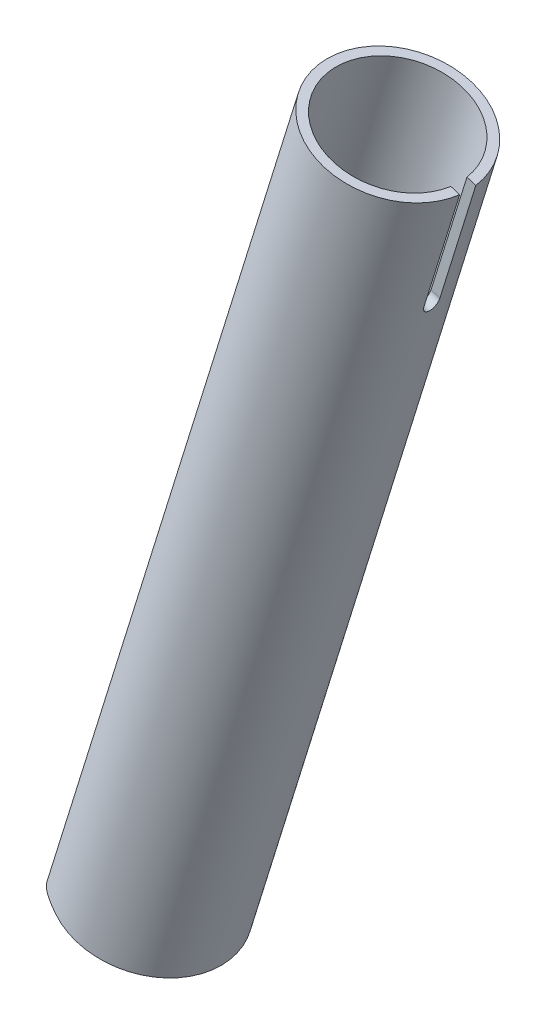
ISO-10303-21;
HEADER;
FILE_DESCRIPTION(('STEP AP214'),'2;1');
FILE_NAME('part.step','',(''),(''),'','','');
FILE_SCHEMA(('AUTOMOTIVE_DESIGN { 1 0 10303 214 1 1 1 1 }'));
ENDSEC;
DATA;
#1=APPLICATION_CONTEXT('core data for automotive mechanical design processes');
#2=APPLICATION_PROTOCOL_DEFINITION('international standard','automotive_design',2000,#1);
#3=PRODUCT_CONTEXT('',#1,'mechanical');
#4=PRODUCT('Part','Part','',(#3));
#5=PRODUCT_RELATED_PRODUCT_CATEGORY('part','',(#4));
#6=PRODUCT_DEFINITION_FORMATION('','',#4);
#7=PRODUCT_DEFINITION_CONTEXT('part definition',#1,'design');
#8=PRODUCT_DEFINITION('design','',#6,#7);
#9=PRODUCT_DEFINITION_SHAPE('','',#8);
#10=(LENGTH_UNIT() NAMED_UNIT(*) SI_UNIT(.MILLI.,.METRE.));
#11=(NAMED_UNIT(*) PLANE_ANGLE_UNIT() SI_UNIT($,.RADIAN.));
#12=(NAMED_UNIT(*) SI_UNIT($,.STERADIAN.) SOLID_ANGLE_UNIT());
#13=UNCERTAINTY_MEASURE_WITH_UNIT(LENGTH_MEASURE(1.E-05),#10,'distance_accuracy_value','');
#14=(GEOMETRIC_REPRESENTATION_CONTEXT(3) GLOBAL_UNCERTAINTY_ASSIGNED_CONTEXT((#13)) GLOBAL_UNIT_ASSIGNED_CONTEXT((#10,
#11,#12)) REPRESENTATION_CONTEXT('',''));
#15=CARTESIAN_POINT('',(0.,0.,0.));
#16=DIRECTION('',(0.,0.,1.));
#17=DIRECTION('',(1.,0.,0.));
#18=AXIS2_PLACEMENT_3D('',#15,#16,#17);
#19=CARTESIAN_POINT('',(71.753350031558,230.850995331577,0.));
#20=DIRECTION('',(0.296814001361883,0.9549353112099,0.));
#21=DIRECTION('',(-0.9549353112099,0.296814001361883,0.));
#22=AXIS2_PLACEMENT_3D('',#19,#20,#21);
#23=CYLINDRICAL_SURFACE('',#22,16.);
#24=CARTESIAN_POINT('',(89.1024615678621,306.882715939735,-14.8323969741913));
#25=CARTESIAN_POINT('',(88.9636789143046,306.925853625691,-14.7736102770657));
#26=CARTESIAN_POINT('',(88.8248106555613,306.965697551553,-14.7126935656479));
#27=CARTESIAN_POINT('',(88.5472654781601,307.038943486681,-14.586759021269));
#28=CARTESIAN_POINT('',(88.4085885291525,307.0723466728,-14.5217419404138));
#29=CARTESIAN_POINT('',(87.9938110120856,307.163026168156,-14.3209864843538));
#30=CARTESIAN_POINT('',(87.7184611401856,307.210926750773,-14.1793309230726));
#31=CARTESIAN_POINT('',(87.1752732700831,307.282773014785,-13.8833327226576));
#32=CARTESIAN_POINT('',(86.9073873822273,307.306957039612,-13.729133543188));
#33=CARTESIAN_POINT('',(86.3779800650861,307.333908688674,-13.4082293127839));
#34=CARTESIAN_POINT('',(86.116461880451,307.336665613374,-13.2415180559385));
#35=CARTESIAN_POINT('',(85.5373138379756,307.320708899526,-12.8542772904973));
#36=CARTESIAN_POINT('',(85.2218916095013,307.296488947746,-12.6306695450833));
#37=CARTESIAN_POINT('',(84.6053720536828,307.220669106254,-12.1689339396761));
#38=CARTESIAN_POINT('',(84.3042767604437,307.169065341215,-11.9308040287452));
#39=CARTESIAN_POINT('',(83.7163306616415,307.041308758366,-11.441248800487));
#40=CARTESIAN_POINT('',(83.4295479929272,306.965049448999,-11.1897698378056));
#41=CARTESIAN_POINT('',(82.8723467146832,306.790885554024,-10.6764756791457));
#42=CARTESIAN_POINT('',(82.6019293065508,306.692979381738,-10.4146597266395));
#43=CARTESIAN_POINT('',(81.9745066955571,306.435664466389,-9.77746944986866));
#44=CARTESIAN_POINT('',(81.6253528216682,306.267220839098,-9.39798788600657));
#45=CARTESIAN_POINT('',(80.95969075539,305.898873380647,-8.62586596573185));
#46=CARTESIAN_POINT('',(80.643195249092,305.698957399693,-8.23322057373231));
#47=CARTESIAN_POINT('',(80.0425697501543,305.272274832941,-7.43754751903833));
#48=CARTESIAN_POINT('',(79.7584595370888,305.045492008597,-7.03451369380498));
#49=CARTESIAN_POINT('',(79.2225479863687,304.569101071878,-6.22072089942956));
#50=CARTESIAN_POINT('',(78.9707427369578,304.319495729327,-5.80996287251813));
#51=CARTESIAN_POINT('',(78.4840201123546,303.784099080961,-4.95617797917473));
#52=CARTESIAN_POINT('',(78.2512063358746,303.497015008781,-4.51276481761032));
#53=CARTESIAN_POINT('',(77.8214597607559,302.903862879695,-3.62118824914521));
#54=CARTESIAN_POINT('',(77.6245336983808,302.597791273177,-3.17302396711186));
#55=CARTESIAN_POINT('',(77.2669543135226,301.970170731178,-2.27465354285216));
#56=CARTESIAN_POINT('',(77.1062273571681,301.648654858773,-1.82445348104745));
#57=CARTESIAN_POINT('',(76.8208035908239,300.992107629926,-0.92274025697174));
#58=CARTESIAN_POINT('',(76.6960892877962,300.657082925796,-0.471227840196273));
#59=CARTESIAN_POINT('',(76.5880768887487,300.311489773514,-0.0132303433696181));
#60=CARTESIAN_POINT('',(76.5865207037954,300.306496904307,-0.00661515629981239));
#61=CARTESIAN_POINT('',(76.5849684421444,300.301502841254,0.));
#62=B_SPLINE_CURVE_WITH_KNOTS('',3,(#24,#25,#26,#27,#28,#29,#30,#31,#32,#33,#34,#35,#36,#37,#38,
#39,#40,#41,#42,#43,#44,#45,#46,#47,#48,#49,#50,#51,#52,#53,#54,#55,#56,#57,#58,#59,#60,#61),
.UNSPECIFIED.,.F.,.F.,(4,2,2,2,2,2,2,2,2,2,2,2,2,2,2,2,2,2,4),(0.,0.47020829482799,
0.940330591632603,1.87888043703225,2.80789844663228,3.73738032781409,4.89786417340659,
6.05851229317381,7.22424196576735,8.39005711270434,10.0150965334015,11.6407648404096,
13.2674207766438,14.8938795574271,16.624146027115,18.3547369407864,20.0817751493295,
21.8079730376149,21.8332712618901),.UNSPECIFIED.);
#63=CARTESIAN_POINT('',(76.5849684421442,300.301502841254,0.));
#64=VERTEX_POINT('',#63);
#65=CARTESIAN_POINT('',(89.1024615678621,306.882715939734,-14.8323969741913));
#66=VERTEX_POINT('',#65);
#67=EDGE_CURVE('E132',#64,#66,#62,.F.);
#68=ORIENTED_EDGE('',*,*,#67,.F.);
#69=CARTESIAN_POINT('',(89.1024615678621,306.882715939735,14.8323969741913));
#70=CARTESIAN_POINT('',(88.9636789143047,306.925853625691,14.7736102770657));
#71=CARTESIAN_POINT('',(88.8248106555614,306.965697551553,14.712693565648));
#72=CARTESIAN_POINT('',(88.5472654781602,307.038943486681,14.5867590212691));
#73=CARTESIAN_POINT('',(88.4085885291527,307.0723466728,14.5217419404139));
#74=CARTESIAN_POINT('',(87.9938110120859,307.163026168156,14.320986484354));
#75=CARTESIAN_POINT('',(87.718461140186,307.210926750773,14.1793309230728));
#76=CARTESIAN_POINT('',(87.1752732700835,307.282773014785,13.8833327226578));
#77=CARTESIAN_POINT('',(86.9073873822275,307.306957039612,13.7291335431881));
#78=CARTESIAN_POINT('',(86.3779800650862,307.333908688674,13.408229312784));
#79=CARTESIAN_POINT('',(86.1164618804511,307.336665613374,13.2415180559385));
#80=CARTESIAN_POINT('',(85.5373138379755,307.320708899526,12.8542772904973));
#81=CARTESIAN_POINT('',(85.2218916095012,307.296488947746,12.6306695450832));
#82=CARTESIAN_POINT('',(84.6053720536826,307.220669106254,12.1689339396759));
#83=CARTESIAN_POINT('',(84.3042767604434,307.169065341215,11.930804028745));
#84=CARTESIAN_POINT('',(83.7163306616413,307.041308758366,11.4412488004868));
#85=CARTESIAN_POINT('',(83.429547992927,306.965049448999,11.1897698378054));
#86=CARTESIAN_POINT('',(82.8723467146831,306.790885554024,10.6764756791456));
#87=CARTESIAN_POINT('',(82.6019293065507,306.692979381738,10.4146597266395));
#88=CARTESIAN_POINT('',(81.9745066955572,306.43566446639,9.77746944986874));
#89=CARTESIAN_POINT('',(81.6253528216684,306.267220839098,9.39798788600675));
#90=CARTESIAN_POINT('',(80.9596907553903,305.898873380648,8.62586596573219));
#91=CARTESIAN_POINT('',(80.6431952490923,305.698957399693,8.23322057373272));
#92=CARTESIAN_POINT('',(80.0425697501547,305.272274832941,7.43754751903876));
#93=CARTESIAN_POINT('',(79.758459537089,305.045492008597,7.03451369380535));
#94=CARTESIAN_POINT('',(79.2225479863688,304.569101071879,6.2207208994297));
#95=CARTESIAN_POINT('',(78.9707427369579,304.319495729327,5.80996287251808));
#96=CARTESIAN_POINT('',(78.4840201123545,303.784099080961,4.95617797917488));
#97=CARTESIAN_POINT('',(78.2512063358743,303.497015008781,4.51276481761089));
#98=CARTESIAN_POINT('',(77.8214597607561,302.903862879696,3.62118824914459));
#99=CARTESIAN_POINT('',(77.6245336983816,302.597791273179,3.17302396710965));
#100=CARTESIAN_POINT('',(77.2669543135218,301.970170731176,2.27465354285411));
#101=CARTESIAN_POINT('',(77.1062273571651,301.648654858763,1.82445348105515));
#102=CARTESIAN_POINT('',(76.8208035908268,300.992107629936,0.922740256963934));
#103=CARTESIAN_POINT('',(76.6960892878072,300.657082925831,0.471227840167233));
#104=CARTESIAN_POINT('',(76.5880768887491,300.311489773515,0.013230343368807));
#105=CARTESIAN_POINT('',(76.5865207037955,300.306496904308,0.00661515629940148));
#106=CARTESIAN_POINT('',(76.5849684421444,300.301502841254,0.));
#107=B_SPLINE_CURVE_WITH_KNOTS('',3,(#69,#70,#71,#72,#73,#74,#75,#76,#77,#78,#79,#80,#81,#82,
#83,#84,#85,#86,#87,#88,#89,#90,#91,#92,#93,#94,#95,#96,#97,#98,#99,#100,#101,#102,#103,#104,
#105,#106),.UNSPECIFIED.,.F.,.F.,(4,2,2,2,2,2,2,2,2,2,2,2,2,2,2,2,2,2,4),(0.,0.470208294827854,
0.940330591632331,1.87888043703174,2.80789844663203,3.73738032781409,4.89786417340678,
6.05851229317418,7.22424196576758,8.39005711270433,10.0150965334011,11.6407648404089,
13.2674207766435,14.893879557427,16.624146027115,18.3547369407866,20.0817751493296,
21.8079730376148,21.8332712618901),.UNSPECIFIED.);
#108=CARTESIAN_POINT('',(89.1024615678621,306.882715939734,14.8323969741913));
#109=VERTEX_POINT('',#108);
#110=EDGE_CURVE('E108',#109,#64,#107,.T.);
#111=ORIENTED_EDGE('',*,*,#110,.F.);
#112=CARTESIAN_POINT('',(94.8320734351215,305.101831931563,0.));
#113=DIRECTION('',(0.296814001361883,0.9549353112099,0.));
#114=DIRECTION('',(-0.9549353112099,0.296814001361883,0.));
#115=AXIS2_PLACEMENT_3D('',#112,#113,#114);
#116=CIRCLE('',#115,16.);
#117=EDGE_CURVE('E137',#66,#109,#116,.F.);
#118=ORIENTED_EDGE('',*,*,#117,.F.);
#119=EDGE_LOOP('',(#68,#111,#118));
#120=FACE_BOUND('',#119,.T.);
#121=CARTESIAN_POINT('',(155.80293286088,447.680071157907,-1.75000000000004));
#122=CARTESIAN_POINT('',(155.788364601699,447.633205295976,-1.74999984854716));
#123=CARTESIAN_POINT('',(155.774023061292,447.586293738003,-1.74793414953128));
#124=CARTESIAN_POINT('',(155.745871314609,447.492676076905,-1.73969438553421));
#125=CARTESIAN_POINT('',(155.732061071143,447.445969959603,-1.73352060866503));
#126=CARTESIAN_POINT('',(155.691590798359,447.306766058352,-1.70890105298895));
#127=CARTESIAN_POINT('',(155.665837052925,447.215008099155,-1.68435685468124));
#128=CARTESIAN_POINT('',(155.61732615962,447.03632763853,-1.61970881462559));
#129=CARTESIAN_POINT('',(155.594570092523,446.949406887584,-1.57959938148605));
#130=CARTESIAN_POINT('',(155.55235522321,446.782918939888,-1.4849728928261));
#131=CARTESIAN_POINT('',(155.532896072991,446.703350967429,-1.43045735947844));
#132=CARTESIAN_POINT('',(155.497345326152,446.553625831101,-1.30832184530033));
#133=CARTESIAN_POINT('',(155.481266647058,446.483505120998,-1.24065343320973));
#134=CARTESIAN_POINT('',(155.452576291235,446.355110628299,-1.09422795085695));
#135=CARTESIAN_POINT('',(155.43996514246,446.296838650101,-1.01546919477598));
#136=CARTESIAN_POINT('',(155.418121580952,446.193801874277,-0.848861111640837));
#137=CARTESIAN_POINT('',(155.408897676371,446.14907113861,-0.760989594645314));
#138=CARTESIAN_POINT('',(155.393781675449,446.074719705114,-0.578809465749656));
#139=CARTESIAN_POINT('',(155.387889283793,446.045097668031,-0.484501425232282));
#140=CARTESIAN_POINT('',(155.379372209535,446.001994281873,-0.292520945329283));
#141=CARTESIAN_POINT('',(155.376734542945,445.988448807305,-0.194863481971559));
#142=CARTESIAN_POINT('',(155.374642682994,445.97772139226,0.00138072986707152));
#143=CARTESIAN_POINT('',(155.375188469676,445.980539349201,0.0999674725184971));
#144=CARTESIAN_POINT('',(155.379463059454,446.00239967363,0.294824184361292));
#145=CARTESIAN_POINT('',(155.383178217962,446.021372491528,0.391102268601931));
#146=CARTESIAN_POINT('',(155.393828846422,446.074844420783,0.579057396518378));
#147=CARTESIAN_POINT('',(155.40076434854,446.109343687228,0.670734394225482));
#148=CARTESIAN_POINT('',(155.417959287271,446.192876631075,0.84710792231627));
#149=CARTESIAN_POINT('',(155.428225711618,446.241940844803,0.931789304333639));
#150=CARTESIAN_POINT('',(155.452164410168,446.353068883408,1.09159834174227));
#151=CARTESIAN_POINT('',(155.465836654893,446.415132595775,1.16672607981105));
#152=CARTESIAN_POINT('',(155.496711127552,446.550742449729,1.30570289475625));
#153=CARTESIAN_POINT('',(155.513931023242,446.624345602888,1.36949242371169));
#154=CARTESIAN_POINT('',(155.551819579913,446.780635490523,1.4835386328046));
#155=CARTESIAN_POINT('',(155.572489278166,446.86332495447,1.53379123080171));
#156=CARTESIAN_POINT('',(155.617096889539,447.035376377061,1.61933675686822));
#157=CARTESIAN_POINT('',(155.641037623537,447.124744064404,1.65461666375557));
#158=CARTESIAN_POINT('',(155.6917824863,447.307398785438,1.70908357833411));
#159=CARTESIAN_POINT('',(155.718582221343,447.400679675159,1.72829488976245));
#160=CARTESIAN_POINT('',(155.755672331281,447.525360419997,1.74281092210031));
#161=CARTESIAN_POINT('',(155.764983517084,447.556314052408,1.74550814429307));
#162=CARTESIAN_POINT('',(155.783808164704,447.618207575417,1.74910025710799));
#163=CARTESIAN_POINT('',(155.793321261443,447.649147402134,1.74999816015541));
#164=CARTESIAN_POINT('',(155.80293286088,447.680071157907,1.74999999999996));
#165=B_SPLINE_CURVE_WITH_KNOTS('',3,(#121,#122,#123,#124,#125,#126,#127,#128,#129,#130,#131,
#132,#133,#134,#135,#136,#137,#138,#139,#140,#141,#142,#143,#144,#145,#146,#147,#148,#149,#150,
#151,#152,#153,#154,#155,#156,#157,#158,#159,#160,#161,#162,#163,#164),.UNSPECIFIED.,.F.,.F.,(4,
2,2,2,2,2,2,2,2,2,2,2,2,2,2,2,2,2,2,2,2,4),(0.,0.147142892768279,0.29427546704506,
0.587999121892365,0.88182838687098,1.17562661776093,1.47052789276596,1.765474043553,
2.06115605928111,2.35681186079465,2.6512843569481,2.94575500706803,3.23896428087547,
3.53217648350591,3.82600781858161,4.11983661065932,4.41516570240261,4.71058375290906,
5.00625819343793,5.30148461375699,5.39875637850416,5.4958651540693),.UNSPECIFIED.);
#166=CARTESIAN_POINT('',(155.80293286088,447.680071157907,-1.75000000000007));
#167=VERTEX_POINT('',#166);
#168=CARTESIAN_POINT('',(155.80293286088,447.680071157907,1.74999999999996));
#169=VERTEX_POINT('',#168);
#170=EDGE_CURVE('E99',#167,#169,#165,.T.);
#171=ORIENTED_EDGE('',*,*,#170,.T.);
#172=DIRECTION('',(0.296814001361883,0.9549353112099,0.));
#173=VECTOR('',#172,1.);
#174=CARTESIAN_POINT('',(86.9406497472459,226.130462803793,1.74999999999997));
#175=LINE('',#174,#173);
#176=CARTESIAN_POINT('',(163.594300396629,472.747123077167,1.74999999999994));
#177=VERTEX_POINT('',#176);
#178=EDGE_CURVE('E86',#169,#177,#175,.T.);
#179=ORIENTED_EDGE('',*,*,#178,.T.);
#180=CARTESIAN_POINT('',(148.407000680941,477.46765560495,0.));
#181=DIRECTION('',(0.296814001361883,0.9549353112099,0.));
#182=DIRECTION('',(-0.9549353112099,0.296814001361883,0.));
#183=AXIS2_PLACEMENT_3D('',#180,#181,#182);
#184=CIRCLE('',#183,16.);
#185=CARTESIAN_POINT('',(163.594300396629,472.747123077167,-1.75000000000005));
#186=VERTEX_POINT('',#185);
#187=EDGE_CURVE('E98',#186,#177,#184,.T.);
#188=ORIENTED_EDGE('',*,*,#187,.F.);
#189=DIRECTION('',(0.296814001361883,0.9549353112099,0.));
#190=VECTOR('',#189,1.);
#191=CARTESIAN_POINT('',(86.9406497472459,226.130462803793,-1.75000000000008));
#192=LINE('',#191,#190);
#193=EDGE_CURVE('E155',#186,#167,#192,.F.);
#194=ORIENTED_EDGE('',*,*,#193,.T.);
#195=EDGE_LOOP('',(#171,#179,#188,#194));
#196=FACE_BOUND('',#195,.T.);
#197=ADVANCED_FACE('F28',(#120,#196),#23,.T.);
#198=CARTESIAN_POINT('',(148.407000680941,477.46765560495,0.));
#199=DIRECTION('',(0.296814001361883,0.9549353112099,0.));
#200=DIRECTION('',(-0.9549353112099,0.296814001361883,0.));
#201=AXIS2_PLACEMENT_3D('',#198,#199,#200);
#202=PLANE('',#201);
#203=ORIENTED_EDGE('',*,*,#187,.T.);
#204=DIRECTION('',(-0.9549353112099,0.296814001361883,0.));
#205=VECTOR('',#204,1.);
#206=CARTESIAN_POINT('',(212.867603300775,457.431943060663,1.74999999999976));
#207=LINE('',#206,#205);
#208=CARTESIAN_POINT('',(161.671237776923,473.344851430411,1.74999999999995));
#209=VERTEX_POINT('',#208);
#210=EDGE_CURVE('E82',#177,#209,#207,.T.);
#211=ORIENTED_EDGE('',*,*,#210,.T.);
#212=CARTESIAN_POINT('',(148.407000680941,477.46765560495,0.));
#213=DIRECTION('',(0.296814001361883,0.9549353112099,0.));
#214=DIRECTION('',(-0.9549353112099,0.296814001361883,0.));
#215=AXIS2_PLACEMENT_3D('',#212,#213,#214);
#216=CIRCLE('',#215,14.);
#217=CARTESIAN_POINT('',(161.671237776923,473.344851430411,-1.75000000000005));
#218=VERTEX_POINT('',#217);
#219=EDGE_CURVE('E103',#218,#209,#216,.T.);
#220=ORIENTED_EDGE('',*,*,#219,.F.);
#221=DIRECTION('',(-0.9549353112099,0.296814001361883,0.));
#222=VECTOR('',#221,1.);
#223=CARTESIAN_POINT('',(212.867603300775,457.431943060663,-1.75000000000023));
#224=LINE('',#223,#222);
#225=EDGE_CURVE('E43',#186,#218,#224,.T.);
#226=ORIENTED_EDGE('',*,*,#225,.F.);
#227=EDGE_LOOP('',(#203,#211,#220,#226));
#228=FACE_BOUND('',#227,.T.);
#229=ADVANCED_FACE('F101',(#228),#202,.T.);
#230=CARTESIAN_POINT('',(71.753350031558,230.850995331577,0.));
#231=DIRECTION('',(0.296814001361883,0.9549353112099,0.));
#232=DIRECTION('',(-0.9549353112099,0.296814001361883,0.));
#233=AXIS2_PLACEMENT_3D('',#230,#231,#232);
#234=CYLINDRICAL_SURFACE('',#233,14.);
#235=CARTESIAN_POINT('',(94.8320734351215,305.101831931563,0.));
#236=DIRECTION('',(0.296814001361883,0.9549353112099,0.));
#237=DIRECTION('',(-0.9549353112099,0.296814001361883,0.));
#238=AXIS2_PLACEMENT_3D('',#235,#236,#237);
#239=CIRCLE('',#238,14.);
#240=CARTESIAN_POINT('',(89.1024615678621,306.882715939734,-12.6491106406735));
#241=VERTEX_POINT('',#240);
#242=CARTESIAN_POINT('',(89.1024615678621,306.882715939734,12.6491106406735));
#243=VERTEX_POINT('',#242);
#244=EDGE_CURVE('E102',#241,#243,#239,.F.);
#245=ORIENTED_EDGE('',*,*,#244,.T.);
#246=CARTESIAN_POINT('',(89.1024615678621,306.882715939735,12.6491106406735));
#247=CARTESIAN_POINT('',(88.9673044257905,306.924726887478,12.5819775953487));
#248=CARTESIAN_POINT('',(88.8323625066707,306.963521406473,12.5124776670643));
#249=CARTESIAN_POINT('',(88.5632906957319,307.034882073019,12.3689276131733));
#250=CARTESIAN_POINT('',(88.4291606381926,307.06744953624,12.2948784531196));
#251=CARTESIAN_POINT('',(88.0289961550427,307.156027053498,12.0664359195482));
#252=CARTESIAN_POINT('',(87.7646570670682,307.203074525025,11.9054840777605));
#253=CARTESIAN_POINT('',(87.2461252062432,307.274776283849,11.5696502679009));
#254=CARTESIAN_POINT('',(86.9918533058094,307.299668769446,11.3949390179701));
#255=CARTESIAN_POINT('',(86.4921825069867,307.330093243404,11.0315020750104));
#256=CARTESIAN_POINT('',(86.2467884052249,307.335614915979,10.8427689693556));
#257=CARTESIAN_POINT('',(85.7050824189154,307.328696077824,10.4029138470756));
#258=CARTESIAN_POINT('',(85.4117736004319,307.311307679232,10.1481688863678));
#259=CARTESIAN_POINT('',(84.8437236144046,307.253841120183,9.62121195246666));
#260=CARTESIAN_POINT('',(84.5689857750399,307.21375890468,9.3489968653335));
#261=CARTESIAN_POINT('',(84.0381473795486,307.114943937555,8.78733011643271));
#262=CARTESIAN_POINT('',(83.7821582129789,307.056109338353,8.49779151110367));
#263=CARTESIAN_POINT('',(83.2918130777177,306.924222523671,7.90410197869587));
#264=CARTESIAN_POINT('',(83.0574556078018,306.851171295911,7.59995206786208));
#265=CARTESIAN_POINT('',(82.6062626761602,306.693451472496,6.97015647313187));
#266=CARTESIAN_POINT('',(82.3899883705727,306.608544553418,6.64416874336027));
#267=CARTESIAN_POINT('',(81.9831743514774,306.433746114573,5.97764022451916));
#268=CARTESIAN_POINT('',(81.7926413090232,306.343853311157,5.63709569292429));
#269=CARTESIAN_POINT('',(81.4403115229442,306.165414249983,4.94234937366581));
#270=CARTESIAN_POINT('',(81.2784336324847,306.076864860781,4.5881897246675));
#271=CARTESIAN_POINT('',(80.9862249963757,305.908067818496,3.86521365282643));
#272=CARTESIAN_POINT('',(80.8558732435672,305.827814657824,3.49640718159235));
#273=CARTESIAN_POINT('',(80.6712590566665,305.709659786955,2.87877044828809));
#274=CARTESIAN_POINT('',(80.6064352939957,305.666857411756,2.63402256840484));
#275=CARTESIAN_POINT('',(80.4930969489905,305.590557273118,2.13932882230145));
#276=CARTESIAN_POINT('',(80.4445796369066,305.557057952482,1.88938383353959));
#277=CARTESIAN_POINT('',(80.3652909663499,305.501633191034,1.38612608292271));
#278=CARTESIAN_POINT('',(80.3344691466365,305.479674854738,1.13282502610313));
#279=CARTESIAN_POINT('',(80.2913756411685,305.448823374969,0.623836609522646));
#280=CARTESIAN_POINT('',(80.2791031634932,305.439929673733,0.368149352103955));
#281=CARTESIAN_POINT('',(80.2735495519917,305.435915918636,-0.144484369758956));
#282=CARTESIAN_POINT('',(80.2803383328821,305.440846570974,-0.401432010008415));
#283=CARTESIAN_POINT('',(80.3128015261206,305.464186381254,-0.913496589163494));
#284=CARTESIAN_POINT('',(80.3384766043649,305.482596014441,-1.1686134631994));
#285=CARTESIAN_POINT('',(80.4079152120161,305.531536929584,-1.67584671356129));
#286=CARTESIAN_POINT('',(80.4517264218909,305.562100155316,-1.92795336485621));
#287=CARTESIAN_POINT('',(80.5561561659966,305.633245300186,-2.42719853641008));
#288=CARTESIAN_POINT('',(80.6167775912002,305.673828942474,-2.67433619426803));
#289=CARTESIAN_POINT('',(80.7845150982114,305.782835524333,-3.27400887793887));
#290=CARTESIAN_POINT('',(80.9002381814753,305.855525701352,-3.62336477716998));
#291=CARTESIAN_POINT('',(81.1603659847424,306.009919120826,-4.30917065910407));
#292=CARTESIAN_POINT('',(81.3047863618685,306.091627272583,-4.64561347639403));
#293=CARTESIAN_POINT('',(81.6196719957247,306.258033989788,-5.30654862357891));
#294=CARTESIAN_POINT('',(81.7902140528144,306.342740787677,-5.63100209316411));
#295=CARTESIAN_POINT('',(82.1547304999634,306.509584731595,-6.26703706732762));
#296=CARTESIAN_POINT('',(82.3487011499441,306.591722285142,-6.57862061579674));
#297=CARTESIAN_POINT('',(82.7710200167666,306.753683648547,-7.20767840847395));
#298=CARTESIAN_POINT('',(83.0007460113944,306.833057778257,-7.52434500423281));
#299=CARTESIAN_POINT('',(83.4832935742,306.978859495105,-8.14279073578437));
#300=CARTESIAN_POINT('',(83.7361169541122,307.045286065367,-8.44456870086456));
#301=CARTESIAN_POINT('',(84.2620791379016,307.160203221229,-9.03056451115627));
#302=CARTESIAN_POINT('',(84.5351011823884,307.20878848783,-9.31486818485061));
#303=CARTESIAN_POINT('',(85.1011770675286,307.283946732158,-9.86601504941642));
#304=CARTESIAN_POINT('',(85.3942294444707,307.310521316452,-10.1328595133319));
#305=CARTESIAN_POINT('',(85.9570330714595,307.335196468406,-10.611633080634));
#306=CARTESIAN_POINT('',(86.224487204044,307.336695129533,-10.8260806679442));
#307=CARTESIAN_POINT('',(86.770916436622,307.316821643711,-11.2383541564241));
#308=CARTESIAN_POINT('',(87.0498842212449,307.295463810285,-11.4361903765751));
#309=CARTESIAN_POINT('',(87.6208074896702,307.226492233938,-11.8158057430607));
#310=CARTESIAN_POINT('',(87.912883479729,307.178546047468,-11.9973470544829));
#311=CARTESIAN_POINT('',(88.3558222519683,307.084660875659,-12.2538742511782));
#312=CARTESIAN_POINT('',(88.5044600712029,307.049647698588,-12.336845627089));
#313=CARTESIAN_POINT('',(88.8027954689342,306.971983917951,-12.497220361763));
#314=CARTESIAN_POINT('',(88.9524933399231,306.929331120756,-12.5746221123022));
#315=CARTESIAN_POINT('',(89.1024615678621,306.882715939735,-12.6491106406735));
#316=B_SPLINE_CURVE_WITH_KNOTS('',3,(#246,#247,#248,#249,#250,#251,#252,#253,#254,#255,#256,
#257,#258,#259,#260,#261,#262,#263,#264,#265,#266,#267,#268,#269,#270,#271,#272,#273,#274,#275,
#276,#277,#278,#279,#280,#281,#282,#283,#284,#285,#286,#287,#288,#289,#290,#291,#292,#293,#294,
#295,#296,#297,#298,#299,#300,#301,#302,#303,#304,#305,#306,#307,#308,#309,#310,#311,#312,#313,
#314,#315),.UNSPECIFIED.,.F.,.F.,(4,2,2,2,2,2,2,2,2,2,2,2,2,2,2,2,2,2,2,2,2,2,2,2,2,2,2,2,2,2,2,
2,2,2,4),(0.,0.469838112647165,0.939576846603763,1.87722023474302,2.8046563730144,
3.7325863358482,4.89751729903213,6.06265648363068,7.23423478372196,8.40573171588529,
9.60557377736122,10.8057261934243,12.0024236186009,13.1983214245403,13.9680368109836,
14.7376232804704,15.5050041214506,16.2723521999729,17.0425185044271,17.8127119648325,
18.5849432792878,19.3573074823279,20.4809115169234,21.6051302767606,22.7327201526386,
23.8601302603634,25.0565777631564,26.2531191947312,27.4432157236075,28.6332253792725,
29.6604321089466,30.6869959427133,31.726694489865,32.2478385980343,32.7691325872079),.UNSPECIFIED.);
#317=EDGE_CURVE('E106',#243,#241,#316,.T.);
#318=ORIENTED_EDGE('',*,*,#317,.T.);
#319=EDGE_LOOP('',(#245,#318));
#320=FACE_BOUND('',#319,.T.);
#321=DIRECTION('',(0.296814001361883,0.9549353112099,0.));
#322=VECTOR('',#321,1.);
#323=CARTESIAN_POINT('',(85.0175871275392,226.728191157038,1.74999999999998));
#324=LINE('',#323,#322);
#325=CARTESIAN_POINT('',(153.879870241173,448.277799511151,1.74999999999997));
#326=VERTEX_POINT('',#325);
#327=EDGE_CURVE('E11',#326,#209,#324,.T.);
#328=ORIENTED_EDGE('',*,*,#327,.F.);
#329=CARTESIAN_POINT('',(153.879870241173,448.277799511151,-1.75000000000003));
#330=CARTESIAN_POINT('',(153.865316055817,448.230979588177,-1.74999990226022));
#331=CARTESIAN_POINT('',(153.851019974381,448.184104236655,-1.74793819107246));
#332=CARTESIAN_POINT('',(153.823020118919,448.090540615428,-1.73971468850188));
#333=CARTESIAN_POINT('',(153.809316299365,448.043852331595,-1.73355321286549));
#334=CARTESIAN_POINT('',(153.769255252017,447.904681917944,-1.70898477345219));
#335=CARTESIAN_POINT('',(153.743892141162,447.812912711915,-1.68449359089691));
#336=CARTESIAN_POINT('',(153.696354876814,447.634148677401,-1.6199944306049));
#337=CARTESIAN_POINT('',(153.674181769894,447.547155421564,-1.57998137631422));
#338=CARTESIAN_POINT('',(153.633256811271,447.380461901285,-1.48559020311536));
#339=CARTESIAN_POINT('',(153.614504692796,447.300761068415,-1.43121320512667));
#340=CARTESIAN_POINT('',(153.580395456263,447.150631467109,-1.30932049682316));
#341=CARTESIAN_POINT('',(153.565055423957,447.080250045437,-1.24174171236773));
#342=CARTESIAN_POINT('',(153.53780964367,446.951321066478,-1.09549079052189));
#343=CARTESIAN_POINT('',(153.525904419042,446.892775312964,-1.01681696532755));
#344=CARTESIAN_POINT('',(153.505353328858,446.789159096057,-0.850294397959981));
#345=CARTESIAN_POINT('',(153.496718299124,446.744133532242,-0.762416364253811));
#346=CARTESIAN_POINT('',(153.482604654522,446.669255350496,-0.580187102931671));
#347=CARTESIAN_POINT('',(153.477125735803,446.63940127198,-0.485836499434002));
#348=CARTESIAN_POINT('',(153.469216858616,446.595951018156,-0.293858146791791));
#349=CARTESIAN_POINT('',(153.466771134392,446.582270792864,-0.196250074503215));
#350=CARTESIAN_POINT('',(153.464813343254,446.571338229643,-8.86340418525662E-05));
#351=CARTESIAN_POINT('',(153.46530123195,446.574085643146,0.0984647198052866));
#352=CARTESIAN_POINT('',(153.469212496112,446.595854835637,0.293135954808519));
#353=CARTESIAN_POINT('',(153.472619449433,446.614785568777,0.389264369530799));
#354=CARTESIAN_POINT('',(153.482431387789,446.66818413192,0.576942013869812));
#355=CARTESIAN_POINT('',(153.48883641351,446.702652172772,0.668491181325092));
#356=CARTESIAN_POINT('',(153.504803072295,446.786144124446,0.844698034577984));
#357=CARTESIAN_POINT('',(153.514373227172,446.835207295022,0.929336337930176));
#358=CARTESIAN_POINT('',(153.536821976055,446.946332526536,1.08910341018505));
#359=CARTESIAN_POINT('',(153.549700582076,447.008394634674,1.164232144556));
#360=CARTESIAN_POINT('',(153.578992040092,447.144100252345,1.30338133936891));
#361=CARTESIAN_POINT('',(153.595428020758,447.217818658738,1.36732390329386));
#362=CARTESIAN_POINT('',(153.631831935873,447.374350575252,1.48169817631124));
#363=CARTESIAN_POINT('',(153.651800917224,447.457166778479,1.53212586949024));
#364=CARTESIAN_POINT('',(153.695173892889,447.629482056066,1.6180424584103));
#365=CARTESIAN_POINT('',(153.718581335537,447.718987794383,1.65351621743756));
#366=CARTESIAN_POINT('',(153.768488438051,447.901899794133,1.70836660100432));
#367=CARTESIAN_POINT('',(153.794983372294,447.995299957733,1.72776746652292));
#368=CARTESIAN_POINT('',(153.831982143944,448.120586224652,1.74257965526041));
#369=CARTESIAN_POINT('',(153.841394125676,448.152045273438,1.74536360439153));
#370=CARTESIAN_POINT('',(153.860455830824,448.214943108434,1.74907128812904));
#371=CARTESIAN_POINT('',(153.870105128261,448.246381839893,1.74999814009577));
#372=CARTESIAN_POINT('',(153.879870241173,448.277799511151,1.74999999999997));
#373=B_SPLINE_CURVE_WITH_KNOTS('',3,(#329,#330,#331,#332,#333,#334,#335,#336,#337,#338,#339,
#340,#341,#342,#343,#344,#345,#346,#347,#348,#349,#350,#351,#352,#353,#354,#355,#356,#357,#358,
#359,#360,#361,#362,#363,#364,#365,#366,#367,#368,#369,#370,#371,#372),.UNSPECIFIED.,.F.,.F.,(4,
2,2,2,2,2,2,2,2,2,2,2,2,2,2,2,2,2,2,2,2,4),(0.,0.146998699670536,0.293986079436231,
0.587398010825424,0.880905985981689,1.17439106341046,1.46931421869473,1.76428228688142,
2.06021935643411,2.35612793022115,2.65049191313542,2.94485144201921,3.23756574856769,
3.53028402751813,3.82379692737795,4.11731089302912,4.41279378980003,4.70836439154306,
5.00423346235073,5.29965548979932,5.3984805564411,5.49713959390784),.UNSPECIFIED.);
#374=CARTESIAN_POINT('',(153.879870241173,448.277799511151,-1.75000000000006));
#375=VERTEX_POINT('',#374);
#376=EDGE_CURVE('E36',#375,#326,#373,.T.);
#377=ORIENTED_EDGE('',*,*,#376,.F.);
#378=DIRECTION('',(0.296814001361883,0.9549353112099,0.));
#379=VECTOR('',#378,1.);
#380=CARTESIAN_POINT('',(85.0175871275392,226.728191157038,-1.75000000000007));
#381=LINE('',#380,#379);
#382=EDGE_CURVE('E119',#218,#375,#381,.F.);
#383=ORIENTED_EDGE('',*,*,#382,.F.);
#384=ORIENTED_EDGE('',*,*,#219,.T.);
#385=EDGE_LOOP('',(#328,#377,#383,#384));
#386=FACE_BOUND('',#385,.T.);
#387=ADVANCED_FACE('F120',(#320,#386),#234,.F.);
#388=CARTESIAN_POINT('',(86.1343215542432,297.333362827635,-16.));
#389=DIRECTION('',(0.,0.,1.));
#390=DIRECTION('',(1.,0.,0.));
#391=AXIS2_PLACEMENT_3D('',#388,#389,#390);
#392=CYLINDRICAL_SURFACE('',#391,9.99999999999997);
#393=ORIENTED_EDGE('',*,*,#110,.T.);
#394=ORIENTED_EDGE('',*,*,#67,.T.);
#395=DIRECTION('',(0.,0.,1.));
#396=VECTOR('',#395,1.);
#397=CARTESIAN_POINT('',(89.1024615678621,306.882715939734,-16.));
#398=LINE('',#397,#396);
#399=EDGE_CURVE('E148',#66,#241,#398,.T.);
#400=ORIENTED_EDGE('',*,*,#399,.T.);
#401=ORIENTED_EDGE('',*,*,#317,.F.);
#402=EDGE_CURVE('E51',#243,#109,#398,.T.);
#403=ORIENTED_EDGE('',*,*,#402,.T.);
#404=EDGE_LOOP('',(#393,#394,#400,#401,#403));
#405=FACE_BOUND('',#404,.T.);
#406=ADVANCED_FACE('F122',(#405),#392,.F.);
#407=CARTESIAN_POINT('',(89.1024615678621,306.882715939734,-16.));
#408=DIRECTION('',(0.296814001361883,0.9549353112099,0.));
#409=DIRECTION('',(-0.9549353112099,0.296814001361883,0.));
#410=AXIS2_PLACEMENT_3D('',#407,#408,#409);
#411=PLANE('',#410);
#412=ORIENTED_EDGE('',*,*,#117,.T.);
#413=ORIENTED_EDGE('',*,*,#402,.F.);
#414=ORIENTED_EDGE('',*,*,#244,.F.);
#415=ORIENTED_EDGE('',*,*,#399,.F.);
#416=EDGE_LOOP('',(#412,#413,#414,#415));
#417=FACE_BOUND('',#416,.T.);
#418=ADVANCED_FACE('F126',(#417),#411,.F.);
#419=CARTESIAN_POINT('',(212.867603300775,457.431943060663,1.74999999999976));
#420=DIRECTION('',(0.,0.,-1.));
#421=DIRECTION('',(-1.,0.,0.));
#422=AXIS2_PLACEMENT_3D('',#419,#420,#421);
#423=PLANE('',#422);
#424=DIRECTION('',(-0.9549353112099,0.296814001361883,0.));
#425=VECTOR('',#424,1.);
#426=CARTESIAN_POINT('',(205.076235765026,432.364891141403,1.74999999999978));
#427=LINE('',#426,#425);
#428=EDGE_CURVE('E172',#169,#326,#427,.T.);
#429=ORIENTED_EDGE('',*,*,#428,.T.);
#430=ORIENTED_EDGE('',*,*,#327,.T.);
#431=ORIENTED_EDGE('',*,*,#210,.F.);
#432=ORIENTED_EDGE('',*,*,#178,.F.);
#433=EDGE_LOOP('',(#429,#430,#431,#432));
#434=FACE_BOUND('',#433,.T.);
#435=ADVANCED_FACE('F85',(#434),#423,.T.);
#436=CARTESIAN_POINT('',(205.076235765026,432.364891141403,-2.18832599756019E-13));
#437=DIRECTION('',(-0.9549353112099,0.296814001361883,0.));
#438=DIRECTION('',(-0.296814001361883,-0.9549353112099,0.));
#439=AXIS2_PLACEMENT_3D('',#436,#437,#438);
#440=CYLINDRICAL_SURFACE('',#439,1.75);
#441=DIRECTION('',(-0.9549353112099,0.296814001361883,0.));
#442=VECTOR('',#441,1.);
#443=CARTESIAN_POINT('',(205.076235765026,432.364891141403,-1.75000000000024));
#444=LINE('',#443,#442);
#445=EDGE_CURVE('E170',#167,#375,#444,.T.);
#446=ORIENTED_EDGE('',*,*,#445,.T.);
#447=ORIENTED_EDGE('',*,*,#376,.T.);
#448=ORIENTED_EDGE('',*,*,#428,.F.);
#449=ORIENTED_EDGE('',*,*,#170,.F.);
#450=EDGE_LOOP('',(#446,#447,#448,#449));
#451=FACE_BOUND('',#450,.T.);
#452=ADVANCED_FACE('F157',(#451),#440,.F.);
#453=CARTESIAN_POINT('',(212.867603300775,457.431943060663,-1.75000000000023));
#454=DIRECTION('',(0.,0.,1.));
#455=DIRECTION('',(1.,0.,0.));
#456=AXIS2_PLACEMENT_3D('',#453,#454,#455);
#457=PLANE('',#456);
#458=ORIENTED_EDGE('',*,*,#225,.T.);
#459=ORIENTED_EDGE('',*,*,#382,.T.);
#460=ORIENTED_EDGE('',*,*,#445,.F.);
#461=ORIENTED_EDGE('',*,*,#193,.F.);
#462=EDGE_LOOP('',(#458,#459,#460,#461));
#463=FACE_BOUND('',#462,.T.);
#464=ADVANCED_FACE('F161',(#463),#457,.T.);
#465=CLOSED_SHELL('',(#197,#229,#387,#406,#418,#435,#452,#464));
#466=MANIFOLD_SOLID_BREP('B2',#465);
#467=ADVANCED_BREP_SHAPE_REPRESENTATION('',(#18,#466),#14);
#468=SHAPE_DEFINITION_REPRESENTATION(#9,#467);
ENDSEC;
END-ISO-10303-21;
